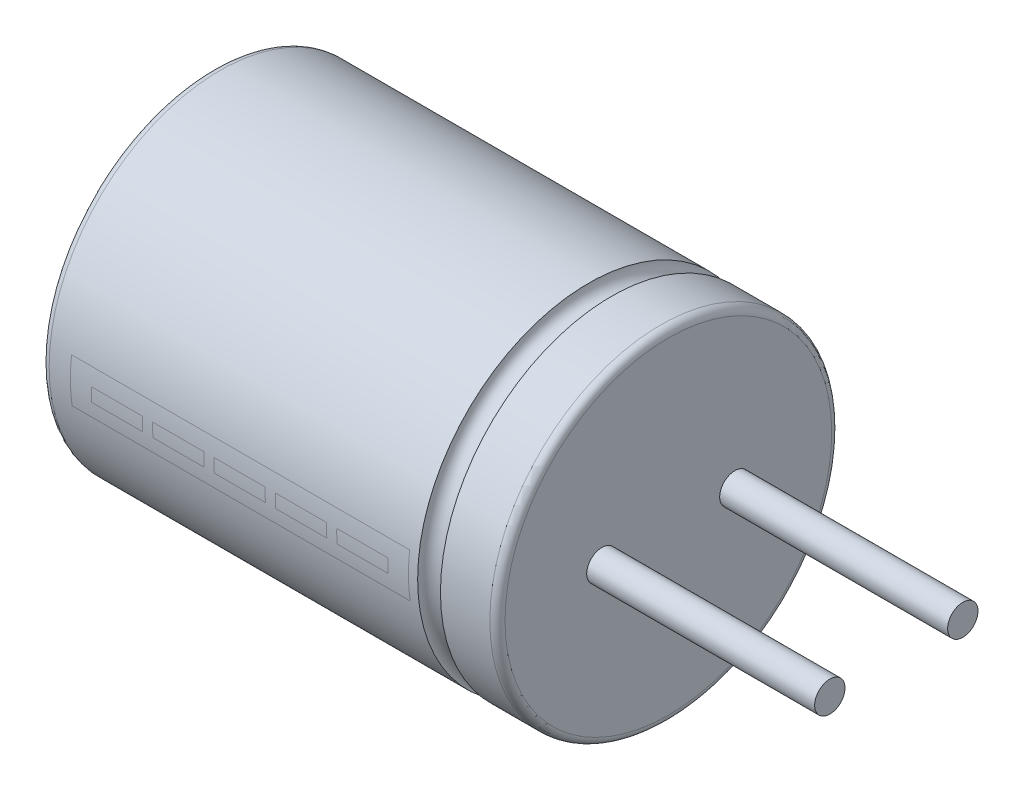
ISO-10303-21;
HEADER;
FILE_DESCRIPTION(('STEP AP214'),'2;1');
FILE_NAME('part.step','',(''),(''),'','','');
FILE_SCHEMA(('AUTOMOTIVE_DESIGN { 1 0 10303 214 1 1 1 1 }'));
ENDSEC;
DATA;
#1=APPLICATION_CONTEXT('core data for automotive mechanical design processes');
#2=APPLICATION_PROTOCOL_DEFINITION('international standard','automotive_design',2000,#1);
#3=PRODUCT_CONTEXT('',#1,'mechanical');
#4=PRODUCT('Part','Part','',(#3));
#5=PRODUCT_RELATED_PRODUCT_CATEGORY('part','',(#4));
#6=PRODUCT_DEFINITION_FORMATION('','',#4);
#7=PRODUCT_DEFINITION_CONTEXT('part definition',#1,'design');
#8=PRODUCT_DEFINITION('design','',#6,#7);
#9=PRODUCT_DEFINITION_SHAPE('','',#8);
#10=(LENGTH_UNIT() NAMED_UNIT(*) SI_UNIT(.MILLI.,.METRE.));
#11=(NAMED_UNIT(*) PLANE_ANGLE_UNIT() SI_UNIT($,.RADIAN.));
#12=(NAMED_UNIT(*) SI_UNIT($,.STERADIAN.) SOLID_ANGLE_UNIT());
#13=UNCERTAINTY_MEASURE_WITH_UNIT(LENGTH_MEASURE(1.E-05),#10,'distance_accuracy_value','');
#14=(GEOMETRIC_REPRESENTATION_CONTEXT(3) GLOBAL_UNCERTAINTY_ASSIGNED_CONTEXT((#13)) GLOBAL_UNIT_ASSIGNED_CONTEXT((#10,
#11,#12)) REPRESENTATION_CONTEXT('',''));
#15=CARTESIAN_POINT('',(0.,0.,0.));
#16=DIRECTION('',(0.,0.,1.));
#17=DIRECTION('',(1.,0.,0.));
#18=AXIS2_PLACEMENT_3D('',#15,#16,#17);
#19=CARTESIAN_POINT('',(-5.95,0.,-2.25));
#20=DIRECTION('',(-1.,0.,0.));
#21=DIRECTION('',(0.,0.,1.));
#22=AXIS2_PLACEMENT_3D('',#19,#20,#21);
#23=CYLINDRICAL_SURFACE('',#22,4.5);
#24=DIRECTION('',(-1.,0.,0.));
#25=VECTOR('',#24,1.);
#26=CARTESIAN_POINT('',(-5.95,0.531396982338142,2.21851398645701));
#27=LINE('',#26,#25);
#28=CARTESIAN_POINT('',(-5.29061789679933,0.531396982338142,2.21851398645701));
#29=VERTEX_POINT('',#28);
#30=CARTESIAN_POINT('',(3.60802987523457,0.531396982338142,2.21851398645701));
#31=VERTEX_POINT('',#30);
#32=EDGE_CURVE('E528',#29,#31,#27,.F.);
#33=ORIENTED_EDGE('',*,*,#32,.T.);
#34=CARTESIAN_POINT('',(3.60802987523457,0.,-2.25));
#35=DIRECTION('',(-1.,0.,0.));
#36=DIRECTION('',(0.,0.,1.));
#37=AXIS2_PLACEMENT_3D('',#34,#35,#36);
#38=CIRCLE('',#37,4.5);
#39=CARTESIAN_POINT('',(3.60802987523457,-0.639477724508424,2.20433140211385));
#40=VERTEX_POINT('',#39);
#41=EDGE_CURVE('E49',#31,#40,#38,.F.);
#42=ORIENTED_EDGE('',*,*,#41,.T.);
#43=DIRECTION('',(-1.,0.,0.));
#44=VECTOR('',#43,1.);
#45=CARTESIAN_POINT('',(-5.95,-0.639477724508424,2.20433140211385));
#46=LINE('',#45,#44);
#47=CARTESIAN_POINT('',(-5.29061789679933,-0.639477724508424,2.20433140211385));
#48=VERTEX_POINT('',#47);
#49=EDGE_CURVE('E41',#40,#48,#46,.T.);
#50=ORIENTED_EDGE('',*,*,#49,.T.);
#51=CARTESIAN_POINT('',(-5.29061789679933,0.,-2.25));
#52=DIRECTION('',(1.,0.,0.));
#53=DIRECTION('',(0.,0.,-1.));
#54=AXIS2_PLACEMENT_3D('',#51,#52,#53);
#55=CIRCLE('',#54,4.5);
#56=EDGE_CURVE('E532',#48,#29,#55,.F.);
#57=ORIENTED_EDGE('',*,*,#56,.T.);
#58=EDGE_LOOP('',(#33,#42,#50,#57));
#59=FACE_BOUND('',#58,.T.);
#60=CARTESIAN_POINT('',(-5.85,0.,-2.25));
#61=DIRECTION('',(-1.,0.,0.));
#62=DIRECTION('',(0.,0.,1.));
#63=AXIS2_PLACEMENT_3D('',#60,#61,#62);
#64=CIRCLE('',#63,4.5);
#65=CARTESIAN_POINT('',(-5.85,0.,2.25));
#66=VERTEX_POINT('',#65);
#67=EDGE_CURVE('E385',#66,#66,#64,.F.);
#68=ORIENTED_EDGE('',*,*,#67,.T.);
#69=EDGE_LOOP('',(#68));
#70=FACE_BOUND('',#69,.T.);
#71=CARTESIAN_POINT('',(3.85,0.,-2.25));
#72=DIRECTION('',(-1.,0.,0.));
#73=DIRECTION('',(0.,0.,1.));
#74=AXIS2_PLACEMENT_3D('',#71,#72,#73);
#75=CIRCLE('',#74,4.5);
#76=CARTESIAN_POINT('',(3.85,0.,2.25));
#77=VERTEX_POINT('',#76);
#78=EDGE_CURVE('E346',#77,#77,#75,.T.);
#79=ORIENTED_EDGE('',*,*,#78,.T.);
#80=EDGE_LOOP('',(#79));
#81=FACE_BOUND('',#80,.T.);
#82=DIRECTION('',(-1.,0.,0.));
#83=VECTOR('',#82,1.);
#84=CARTESIAN_POINT('',(-5.95,-0.639477724508424,-6.70433140211385));
#85=LINE('',#84,#83);
#86=CARTESIAN_POINT('',(-5.29061789679933,-0.639477724508424,-6.70433140211385));
#87=VERTEX_POINT('',#86);
#88=CARTESIAN_POINT('',(3.60802987523457,-0.639477724508424,-6.70433140211385));
#89=VERTEX_POINT('',#88);
#90=EDGE_CURVE('E527',#87,#89,#85,.F.);
#91=ORIENTED_EDGE('',*,*,#90,.T.);
#92=CARTESIAN_POINT('',(3.60802987523457,0.531396982338142,-6.71851398645701));
#93=VERTEX_POINT('',#92);
#94=EDGE_CURVE('E11',#89,#93,#38,.F.);
#95=ORIENTED_EDGE('',*,*,#94,.T.);
#96=DIRECTION('',(-1.,0.,0.));
#97=VECTOR('',#96,1.);
#98=CARTESIAN_POINT('',(-5.95,0.531396982338142,-6.71851398645701));
#99=LINE('',#98,#97);
#100=CARTESIAN_POINT('',(-5.29061789679933,0.531396982338142,-6.71851398645701));
#101=VERTEX_POINT('',#100);
#102=EDGE_CURVE('E47',#93,#101,#99,.T.);
#103=ORIENTED_EDGE('',*,*,#102,.T.);
#104=EDGE_CURVE('E535',#101,#87,#55,.F.);
#105=ORIENTED_EDGE('',*,*,#104,.T.);
#106=EDGE_LOOP('',(#91,#95,#103,#105));
#107=FACE_BOUND('',#106,.T.);
#108=ADVANCED_FACE('F37',(#59,#70,#81,#107),#23,.T.);
#109=ORIENTED_EDGE('',*,*,#94,.F.);
#110=ORIENTED_EDGE('',*,*,#90,.F.);
#111=ORIENTED_EDGE('',*,*,#104,.F.);
#112=ORIENTED_EDGE('',*,*,#102,.F.);
#113=EDGE_LOOP('',(#109,#110,#111,#112));
#114=FACE_BOUND('',#113,.T.);
#115=CARTESIAN_POINT('',(-4.74169300053055,0.,-2.25));
#116=DIRECTION('',(-1.,0.,0.));
#117=DIRECTION('',(0.,0.,1.));
#118=AXIS2_PLACEMENT_3D('',#115,#116,#117);
#119=CIRCLE('',#118,4.5);
#120=CARTESIAN_POINT('',(-4.74169300053055,-0.265403167091742,-6.74216664415933));
#121=VERTEX_POINT('',#120);
#122=CARTESIAN_POINT('',(-4.74169300053055,0.093571191882617,-6.74902705393618));
#123=VERTEX_POINT('',#122);
#124=EDGE_CURVE('E422',#121,#123,#119,.F.);
#125=ORIENTED_EDGE('',*,*,#124,.F.);
#126=DIRECTION('',(-1.,0.,0.));
#127=VECTOR('',#126,1.);
#128=CARTESIAN_POINT('',(-5.95,-0.265403167091742,-6.74216664415933));
#129=LINE('',#128,#127);
#130=CARTESIAN_POINT('',(-3.3955391543767,-0.265403167091742,-6.74216664415933));
#131=VERTEX_POINT('',#130);
#132=EDGE_CURVE('E388',#131,#121,#129,.T.);
#133=ORIENTED_EDGE('',*,*,#132,.F.);
#134=CARTESIAN_POINT('',(-3.3955391543767,0.,-2.25));
#135=DIRECTION('',(1.,0.,0.));
#136=DIRECTION('',(0.,0.,-1.));
#137=AXIS2_PLACEMENT_3D('',#134,#135,#136);
#138=CIRCLE('',#137,4.5);
#139=CARTESIAN_POINT('',(-3.3955391543767,0.093571191882617,-6.74902705393618));
#140=VERTEX_POINT('',#139);
#141=EDGE_CURVE('E415',#140,#131,#138,.F.);
#142=ORIENTED_EDGE('',*,*,#141,.F.);
#143=DIRECTION('',(-1.,0.,0.));
#144=VECTOR('',#143,1.);
#145=CARTESIAN_POINT('',(-5.95,0.093571191882617,-6.74902705393618));
#146=LINE('',#145,#144);
#147=EDGE_CURVE('E418',#123,#140,#146,.F.);
#148=ORIENTED_EDGE('',*,*,#147,.F.);
#149=EDGE_LOOP('',(#125,#133,#142,#148));
#150=FACE_BOUND('',#149,.T.);
#151=CARTESIAN_POINT('',(-3.12630838514593,0.,-2.25));
#152=DIRECTION('',(-1.,0.,0.));
#153=DIRECTION('',(0.,0.,1.));
#154=AXIS2_PLACEMENT_3D('',#151,#152,#153);
#155=CIRCLE('',#154,4.5);
#156=CARTESIAN_POINT('',(-3.12630838514593,-0.265403167091742,-6.74216664415933));
#157=VERTEX_POINT('',#156);
#158=CARTESIAN_POINT('',(-3.12630838514593,0.093571191882617,-6.74902705393618));
#159=VERTEX_POINT('',#158);
#160=EDGE_CURVE('E445',#157,#159,#155,.F.);
#161=ORIENTED_EDGE('',*,*,#160,.F.);
#162=DIRECTION('',(-1.,0.,0.));
#163=VECTOR('',#162,1.);
#164=CARTESIAN_POINT('',(-5.95,-0.265403167091742,-6.74216664415933));
#165=LINE('',#164,#163);
#166=CARTESIAN_POINT('',(-1.78015453899209,-0.265403167091742,-6.74216664415933));
#167=VERTEX_POINT('',#166);
#168=EDGE_CURVE('E434',#167,#157,#165,.T.);
#169=ORIENTED_EDGE('',*,*,#168,.F.);
#170=CARTESIAN_POINT('',(-1.78015453899209,0.,-2.25));
#171=DIRECTION('',(1.,0.,0.));
#172=DIRECTION('',(0.,0.,-1.));
#173=AXIS2_PLACEMENT_3D('',#170,#171,#172);
#174=CIRCLE('',#173,4.5);
#175=CARTESIAN_POINT('',(-1.78015453899209,0.093571191882617,-6.74902705393618));
#176=VERTEX_POINT('',#175);
#177=EDGE_CURVE('E438',#176,#167,#174,.F.);
#178=ORIENTED_EDGE('',*,*,#177,.F.);
#179=DIRECTION('',(-1.,0.,0.));
#180=VECTOR('',#179,1.);
#181=CARTESIAN_POINT('',(-5.95,0.093571191882617,-6.74902705393618));
#182=LINE('',#181,#180);
#183=EDGE_CURVE('E441',#159,#176,#182,.F.);
#184=ORIENTED_EDGE('',*,*,#183,.F.);
#185=EDGE_LOOP('',(#161,#169,#178,#184));
#186=FACE_BOUND('',#185,.T.);
#187=CARTESIAN_POINT('',(-1.51092376976132,0.,-2.25));
#188=DIRECTION('',(-1.,0.,0.));
#189=DIRECTION('',(0.,0.,1.));
#190=AXIS2_PLACEMENT_3D('',#187,#188,#189);
#191=CIRCLE('',#190,4.5);
#192=CARTESIAN_POINT('',(-1.51092376976132,-0.265403167091742,-6.74216664415933));
#193=VERTEX_POINT('',#192);
#194=CARTESIAN_POINT('',(-1.51092376976132,0.093571191882617,-6.74902705393618));
#195=VERTEX_POINT('',#194);
#196=EDGE_CURVE('E468',#193,#195,#191,.F.);
#197=ORIENTED_EDGE('',*,*,#196,.F.);
#198=DIRECTION('',(-1.,0.,0.));
#199=VECTOR('',#198,1.);
#200=CARTESIAN_POINT('',(-5.95,-0.265403167091742,-6.74216664415933));
#201=LINE('',#200,#199);
#202=CARTESIAN_POINT('',(-0.164769923607473,-0.265403167091742,-6.74216664415933));
#203=VERTEX_POINT('',#202);
#204=EDGE_CURVE('E457',#203,#193,#201,.T.);
#205=ORIENTED_EDGE('',*,*,#204,.F.);
#206=CARTESIAN_POINT('',(-0.164769923607473,0.,-2.25));
#207=DIRECTION('',(1.,0.,0.));
#208=DIRECTION('',(0.,0.,-1.));
#209=AXIS2_PLACEMENT_3D('',#206,#207,#208);
#210=CIRCLE('',#209,4.5);
#211=CARTESIAN_POINT('',(-0.164769923607473,0.093571191882617,-6.74902705393618));
#212=VERTEX_POINT('',#211);
#213=EDGE_CURVE('E461',#212,#203,#210,.F.);
#214=ORIENTED_EDGE('',*,*,#213,.F.);
#215=DIRECTION('',(-1.,0.,0.));
#216=VECTOR('',#215,1.);
#217=CARTESIAN_POINT('',(-5.95,0.093571191882617,-6.74902705393618));
#218=LINE('',#217,#216);
#219=EDGE_CURVE('E464',#195,#212,#218,.F.);
#220=ORIENTED_EDGE('',*,*,#219,.F.);
#221=EDGE_LOOP('',(#197,#205,#214,#220));
#222=FACE_BOUND('',#221,.T.);
#223=CARTESIAN_POINT('',(0.104460845623297,0.,-2.25));
#224=DIRECTION('',(-1.,0.,0.));
#225=DIRECTION('',(0.,0.,1.));
#226=AXIS2_PLACEMENT_3D('',#223,#224,#225);
#227=CIRCLE('',#226,4.5);
#228=CARTESIAN_POINT('',(0.104460845623297,-0.265403167091742,-6.74216664415933));
#229=VERTEX_POINT('',#228);
#230=CARTESIAN_POINT('',(0.104460845623297,0.093571191882617,-6.74902705393618));
#231=VERTEX_POINT('',#230);
#232=EDGE_CURVE('E491',#229,#231,#227,.F.);
#233=ORIENTED_EDGE('',*,*,#232,.F.);
#234=DIRECTION('',(-1.,0.,0.));
#235=VECTOR('',#234,1.);
#236=CARTESIAN_POINT('',(-5.95,-0.265403167091742,-6.74216664415933));
#237=LINE('',#236,#235);
#238=CARTESIAN_POINT('',(1.45061469177714,-0.265403167091742,-6.74216664415933));
#239=VERTEX_POINT('',#238);
#240=EDGE_CURVE('E480',#239,#229,#237,.T.);
#241=ORIENTED_EDGE('',*,*,#240,.F.);
#242=CARTESIAN_POINT('',(1.45061469177714,0.,-2.25));
#243=DIRECTION('',(1.,0.,0.));
#244=DIRECTION('',(0.,0.,-1.));
#245=AXIS2_PLACEMENT_3D('',#242,#243,#244);
#246=CIRCLE('',#245,4.5);
#247=CARTESIAN_POINT('',(1.45061469177714,0.093571191882617,-6.74902705393618));
#248=VERTEX_POINT('',#247);
#249=EDGE_CURVE('E484',#248,#239,#246,.F.);
#250=ORIENTED_EDGE('',*,*,#249,.F.);
#251=DIRECTION('',(-1.,0.,0.));
#252=VECTOR('',#251,1.);
#253=CARTESIAN_POINT('',(-5.95,0.093571191882617,-6.74902705393618));
#254=LINE('',#253,#252);
#255=EDGE_CURVE('E487',#231,#248,#254,.F.);
#256=ORIENTED_EDGE('',*,*,#255,.F.);
#257=EDGE_LOOP('',(#233,#241,#250,#256));
#258=FACE_BOUND('',#257,.T.);
#259=CARTESIAN_POINT('',(1.71984546100791,0.,-2.25));
#260=DIRECTION('',(-1.,0.,0.));
#261=DIRECTION('',(0.,0.,1.));
#262=AXIS2_PLACEMENT_3D('',#259,#260,#261);
#263=CIRCLE('',#262,4.5);
#264=CARTESIAN_POINT('',(1.71984546100791,-0.265403167091742,-6.74216664415933));
#265=VERTEX_POINT('',#264);
#266=CARTESIAN_POINT('',(1.71984546100791,0.093571191882617,-6.74902705393618));
#267=VERTEX_POINT('',#266);
#268=EDGE_CURVE('E514',#265,#267,#263,.F.);
#269=ORIENTED_EDGE('',*,*,#268,.F.);
#270=DIRECTION('',(-1.,0.,0.));
#271=VECTOR('',#270,1.);
#272=CARTESIAN_POINT('',(-5.95,-0.265403167091742,-6.74216664415933));
#273=LINE('',#272,#271);
#274=CARTESIAN_POINT('',(3.06599930716176,-0.265403167091742,-6.74216664415933));
#275=VERTEX_POINT('',#274);
#276=EDGE_CURVE('E503',#275,#265,#273,.T.);
#277=ORIENTED_EDGE('',*,*,#276,.F.);
#278=CARTESIAN_POINT('',(3.06599930716176,0.,-2.25));
#279=DIRECTION('',(1.,0.,0.));
#280=DIRECTION('',(0.,0.,-1.));
#281=AXIS2_PLACEMENT_3D('',#278,#279,#280);
#282=CIRCLE('',#281,4.5);
#283=CARTESIAN_POINT('',(3.06599930716176,0.093571191882617,-6.74902705393618));
#284=VERTEX_POINT('',#283);
#285=EDGE_CURVE('E507',#284,#275,#282,.F.);
#286=ORIENTED_EDGE('',*,*,#285,.F.);
#287=DIRECTION('',(-1.,0.,0.));
#288=VECTOR('',#287,1.);
#289=CARTESIAN_POINT('',(-5.95,0.093571191882617,-6.74902705393618));
#290=LINE('',#289,#288);
#291=EDGE_CURVE('E510',#267,#284,#290,.F.);
#292=ORIENTED_EDGE('',*,*,#291,.F.);
#293=EDGE_LOOP('',(#269,#277,#286,#292));
#294=FACE_BOUND('',#293,.T.);
#295=ADVANCED_FACE('F546',(#114,#150,#186,#222,#258,#294),#23,.T.);
#296=DIRECTION('',(-1.,0.,0.));
#297=VECTOR('',#296,1.);
#298=CARTESIAN_POINT('',(-5.95,0.093571191882617,2.24902705393618));
#299=LINE('',#298,#297);
#300=CARTESIAN_POINT('',(3.06599930716176,0.093571191882617,2.24902705393618));
#301=VERTEX_POINT('',#300);
#302=CARTESIAN_POINT('',(1.71984546100791,0.093571191882617,2.24902705393618));
#303=VERTEX_POINT('',#302);
#304=EDGE_CURVE('E522',#301,#303,#299,.T.);
#305=ORIENTED_EDGE('',*,*,#304,.T.);
#306=CARTESIAN_POINT('',(1.71984546100791,-0.265403167091742,2.24216664415933));
#307=VERTEX_POINT('',#306);
#308=EDGE_CURVE('E518',#303,#307,#263,.F.);
#309=ORIENTED_EDGE('',*,*,#308,.T.);
#310=DIRECTION('',(-1.,0.,0.));
#311=VECTOR('',#310,1.);
#312=CARTESIAN_POINT('',(-5.95,-0.265403167091742,2.24216664415933));
#313=LINE('',#312,#311);
#314=CARTESIAN_POINT('',(3.06599930716176,-0.265403167091742,2.24216664415933));
#315=VERTEX_POINT('',#314);
#316=EDGE_CURVE('E517',#307,#315,#313,.F.);
#317=ORIENTED_EDGE('',*,*,#316,.T.);
#318=EDGE_CURVE('E511',#315,#301,#282,.F.);
#319=ORIENTED_EDGE('',*,*,#318,.T.);
#320=EDGE_LOOP('',(#305,#309,#317,#319));
#321=FACE_BOUND('',#320,.T.);
#322=ADVANCED_FACE('F549',(#321),#23,.T.);
#323=ORIENTED_EDGE('',*,*,#276,.T.);
#324=ORIENTED_EDGE('',*,*,#268,.T.);
#325=ORIENTED_EDGE('',*,*,#291,.T.);
#326=ORIENTED_EDGE('',*,*,#285,.T.);
#327=EDGE_LOOP('',(#323,#324,#325,#326));
#328=FACE_BOUND('',#327,.T.);
#329=ADVANCED_FACE('F567',(#328),#23,.T.);
#330=DIRECTION('',(-1.,0.,0.));
#331=VECTOR('',#330,1.);
#332=CARTESIAN_POINT('',(-5.95,0.093571191882617,2.24902705393618));
#333=LINE('',#332,#331);
#334=CARTESIAN_POINT('',(1.45061469177714,0.093571191882617,2.24902705393618));
#335=VERTEX_POINT('',#334);
#336=CARTESIAN_POINT('',(0.104460845623297,0.093571191882617,2.24902705393618));
#337=VERTEX_POINT('',#336);
#338=EDGE_CURVE('E499',#335,#337,#333,.T.);
#339=ORIENTED_EDGE('',*,*,#338,.T.);
#340=CARTESIAN_POINT('',(0.104460845623297,-0.265403167091742,2.24216664415933));
#341=VERTEX_POINT('',#340);
#342=EDGE_CURVE('E495',#337,#341,#227,.F.);
#343=ORIENTED_EDGE('',*,*,#342,.T.);
#344=DIRECTION('',(-1.,0.,0.));
#345=VECTOR('',#344,1.);
#346=CARTESIAN_POINT('',(-5.95,-0.265403167091742,2.24216664415933));
#347=LINE('',#346,#345);
#348=CARTESIAN_POINT('',(1.45061469177714,-0.265403167091742,2.24216664415933));
#349=VERTEX_POINT('',#348);
#350=EDGE_CURVE('E494',#341,#349,#347,.F.);
#351=ORIENTED_EDGE('',*,*,#350,.T.);
#352=EDGE_CURVE('E488',#349,#335,#246,.F.);
#353=ORIENTED_EDGE('',*,*,#352,.T.);
#354=EDGE_LOOP('',(#339,#343,#351,#353));
#355=FACE_BOUND('',#354,.T.);
#356=ADVANCED_FACE('F569',(#355),#23,.T.);
#357=ORIENTED_EDGE('',*,*,#240,.T.);
#358=ORIENTED_EDGE('',*,*,#232,.T.);
#359=ORIENTED_EDGE('',*,*,#255,.T.);
#360=ORIENTED_EDGE('',*,*,#249,.T.);
#361=EDGE_LOOP('',(#357,#358,#359,#360));
#362=FACE_BOUND('',#361,.T.);
#363=ADVANCED_FACE('F574',(#362),#23,.T.);
#364=DIRECTION('',(-1.,0.,0.));
#365=VECTOR('',#364,1.);
#366=CARTESIAN_POINT('',(-5.95,0.093571191882617,2.24902705393618));
#367=LINE('',#366,#365);
#368=CARTESIAN_POINT('',(-0.164769923607473,0.093571191882617,2.24902705393618));
#369=VERTEX_POINT('',#368);
#370=CARTESIAN_POINT('',(-1.51092376976132,0.093571191882617,2.24902705393618));
#371=VERTEX_POINT('',#370);
#372=EDGE_CURVE('E476',#369,#371,#367,.T.);
#373=ORIENTED_EDGE('',*,*,#372,.T.);
#374=CARTESIAN_POINT('',(-1.51092376976132,-0.265403167091742,2.24216664415933));
#375=VERTEX_POINT('',#374);
#376=EDGE_CURVE('E472',#371,#375,#191,.F.);
#377=ORIENTED_EDGE('',*,*,#376,.T.);
#378=DIRECTION('',(-1.,0.,0.));
#379=VECTOR('',#378,1.);
#380=CARTESIAN_POINT('',(-5.95,-0.265403167091742,2.24216664415933));
#381=LINE('',#380,#379);
#382=CARTESIAN_POINT('',(-0.164769923607473,-0.265403167091742,2.24216664415933));
#383=VERTEX_POINT('',#382);
#384=EDGE_CURVE('E471',#375,#383,#381,.F.);
#385=ORIENTED_EDGE('',*,*,#384,.T.);
#386=EDGE_CURVE('E465',#383,#369,#210,.F.);
#387=ORIENTED_EDGE('',*,*,#386,.T.);
#388=EDGE_LOOP('',(#373,#377,#385,#387));
#389=FACE_BOUND('',#388,.T.);
#390=ADVANCED_FACE('F737',(#389),#23,.T.);
#391=ORIENTED_EDGE('',*,*,#204,.T.);
#392=ORIENTED_EDGE('',*,*,#196,.T.);
#393=ORIENTED_EDGE('',*,*,#219,.T.);
#394=ORIENTED_EDGE('',*,*,#213,.T.);
#395=EDGE_LOOP('',(#391,#392,#393,#394));
#396=FACE_BOUND('',#395,.T.);
#397=ADVANCED_FACE('F733',(#396),#23,.T.);
#398=DIRECTION('',(-1.,0.,0.));
#399=VECTOR('',#398,1.);
#400=CARTESIAN_POINT('',(-5.95,0.093571191882617,2.24902705393618));
#401=LINE('',#400,#399);
#402=CARTESIAN_POINT('',(-1.78015453899209,0.093571191882617,2.24902705393618));
#403=VERTEX_POINT('',#402);
#404=CARTESIAN_POINT('',(-3.12630838514593,0.093571191882617,2.24902705393618));
#405=VERTEX_POINT('',#404);
#406=EDGE_CURVE('E453',#403,#405,#401,.T.);
#407=ORIENTED_EDGE('',*,*,#406,.T.);
#408=CARTESIAN_POINT('',(-3.12630838514593,-0.265403167091742,2.24216664415933));
#409=VERTEX_POINT('',#408);
#410=EDGE_CURVE('E449',#405,#409,#155,.F.);
#411=ORIENTED_EDGE('',*,*,#410,.T.);
#412=DIRECTION('',(-1.,0.,0.));
#413=VECTOR('',#412,1.);
#414=CARTESIAN_POINT('',(-5.95,-0.265403167091742,2.24216664415933));
#415=LINE('',#414,#413);
#416=CARTESIAN_POINT('',(-1.78015453899209,-0.265403167091742,2.24216664415933));
#417=VERTEX_POINT('',#416);
#418=EDGE_CURVE('E448',#409,#417,#415,.F.);
#419=ORIENTED_EDGE('',*,*,#418,.T.);
#420=EDGE_CURVE('E442',#417,#403,#174,.F.);
#421=ORIENTED_EDGE('',*,*,#420,.T.);
#422=EDGE_LOOP('',(#407,#411,#419,#421));
#423=FACE_BOUND('',#422,.T.);
#424=ADVANCED_FACE('F614',(#423),#23,.T.);
#425=ORIENTED_EDGE('',*,*,#168,.T.);
#426=ORIENTED_EDGE('',*,*,#160,.T.);
#427=ORIENTED_EDGE('',*,*,#183,.T.);
#428=ORIENTED_EDGE('',*,*,#177,.T.);
#429=EDGE_LOOP('',(#425,#426,#427,#428));
#430=FACE_BOUND('',#429,.T.);
#431=ADVANCED_FACE('F608',(#430),#23,.T.);
#432=DIRECTION('',(-1.,0.,0.));
#433=VECTOR('',#432,1.);
#434=CARTESIAN_POINT('',(-5.95,0.093571191882617,2.24902705393618));
#435=LINE('',#434,#433);
#436=CARTESIAN_POINT('',(-3.3955391543767,0.093571191882617,2.24902705393618));
#437=VERTEX_POINT('',#436);
#438=CARTESIAN_POINT('',(-4.74169300053055,0.093571191882617,2.24902705393618));
#439=VERTEX_POINT('',#438);
#440=EDGE_CURVE('E430',#437,#439,#435,.T.);
#441=ORIENTED_EDGE('',*,*,#440,.T.);
#442=CARTESIAN_POINT('',(-4.74169300053055,-0.265403167091742,2.24216664415933));
#443=VERTEX_POINT('',#442);
#444=EDGE_CURVE('E426',#439,#443,#119,.F.);
#445=ORIENTED_EDGE('',*,*,#444,.T.);
#446=DIRECTION('',(-1.,0.,0.));
#447=VECTOR('',#446,1.);
#448=CARTESIAN_POINT('',(-5.95,-0.265403167091742,2.24216664415933));
#449=LINE('',#448,#447);
#450=CARTESIAN_POINT('',(-3.3955391543767,-0.265403167091742,2.24216664415933));
#451=VERTEX_POINT('',#450);
#452=EDGE_CURVE('E425',#443,#451,#449,.F.);
#453=ORIENTED_EDGE('',*,*,#452,.T.);
#454=EDGE_CURVE('E419',#451,#437,#138,.F.);
#455=ORIENTED_EDGE('',*,*,#454,.T.);
#456=EDGE_LOOP('',(#441,#445,#453,#455));
#457=FACE_BOUND('',#456,.T.);
#458=ADVANCED_FACE('F600',(#457),#23,.T.);
#459=ORIENTED_EDGE('',*,*,#132,.T.);
#460=ORIENTED_EDGE('',*,*,#124,.T.);
#461=ORIENTED_EDGE('',*,*,#147,.T.);
#462=ORIENTED_EDGE('',*,*,#141,.T.);
#463=EDGE_LOOP('',(#459,#460,#461,#462));
#464=FACE_BOUND('',#463,.T.);
#465=ADVANCED_FACE('F589',(#464),#23,.T.);
#466=CARTESIAN_POINT('',(-5.95,0.,-2.25));
#467=DIRECTION('',(-1.,0.,0.));
#468=DIRECTION('',(0.,0.,1.));
#469=AXIS2_PLACEMENT_3D('',#466,#467,#468);
#470=CYLINDRICAL_SURFACE('',#469,4.5);
#471=CARTESIAN_POINT('',(5.75,0.,-2.25));
#472=DIRECTION('',(1.,0.,0.));
#473=DIRECTION('',(0.,0.,-1.));
#474=AXIS2_PLACEMENT_3D('',#471,#472,#473);
#475=CIRCLE('',#474,4.5);
#476=CARTESIAN_POINT('',(5.75,0.,-6.75));
#477=VERTEX_POINT('',#476);
#478=EDGE_CURVE('E352',#477,#477,#475,.F.);
#479=ORIENTED_EDGE('',*,*,#478,.T.);
#480=EDGE_LOOP('',(#479));
#481=FACE_BOUND('',#480,.T.);
#482=CARTESIAN_POINT('',(4.45,0.,-2.25));
#483=DIRECTION('',(-1.,0.,0.));
#484=DIRECTION('',(0.,0.,1.));
#485=AXIS2_PLACEMENT_3D('',#482,#483,#484);
#486=CIRCLE('',#485,4.5);
#487=CARTESIAN_POINT('',(4.45,0.,2.25));
#488=VERTEX_POINT('',#487);
#489=EDGE_CURVE('E349',#488,#488,#486,.T.);
#490=ORIENTED_EDGE('',*,*,#489,.F.);
#491=EDGE_LOOP('',(#490));
#492=FACE_BOUND('',#491,.T.);
#493=ADVANCED_FACE('F596',(#481,#492),#470,.T.);
#494=CARTESIAN_POINT('',(4.15,0.,-2.25));
#495=DIRECTION('',(-1.,0.,0.));
#496=DIRECTION('',(0.,0.,1.));
#497=AXIS2_PLACEMENT_3D('',#494,#495,#496);
#498=TOROIDAL_SURFACE('',#497,4.5,0.3);
#499=ORIENTED_EDGE('',*,*,#489,.T.);
#500=EDGE_LOOP('',(#499));
#501=FACE_BOUND('',#500,.T.);
#502=ORIENTED_EDGE('',*,*,#78,.F.);
#503=EDGE_LOOP('',(#502));
#504=FACE_BOUND('',#503,.T.);
#505=ADVANCED_FACE('F587',(#501,#504),#498,.F.);
#506=ORIENTED_EDGE('',*,*,#41,.F.);
#507=ORIENTED_EDGE('',*,*,#32,.F.);
#508=ORIENTED_EDGE('',*,*,#56,.F.);
#509=ORIENTED_EDGE('',*,*,#49,.F.);
#510=EDGE_LOOP('',(#506,#507,#508,#509));
#511=FACE_BOUND('',#510,.T.);
#512=ORIENTED_EDGE('',*,*,#308,.F.);
#513=ORIENTED_EDGE('',*,*,#304,.F.);
#514=ORIENTED_EDGE('',*,*,#318,.F.);
#515=ORIENTED_EDGE('',*,*,#316,.F.);
#516=EDGE_LOOP('',(#512,#513,#514,#515));
#517=FACE_BOUND('',#516,.T.);
#518=ORIENTED_EDGE('',*,*,#342,.F.);
#519=ORIENTED_EDGE('',*,*,#338,.F.);
#520=ORIENTED_EDGE('',*,*,#352,.F.);
#521=ORIENTED_EDGE('',*,*,#350,.F.);
#522=EDGE_LOOP('',(#518,#519,#520,#521));
#523=FACE_BOUND('',#522,.T.);
#524=ORIENTED_EDGE('',*,*,#376,.F.);
#525=ORIENTED_EDGE('',*,*,#372,.F.);
#526=ORIENTED_EDGE('',*,*,#386,.F.);
#527=ORIENTED_EDGE('',*,*,#384,.F.);
#528=EDGE_LOOP('',(#524,#525,#526,#527));
#529=FACE_BOUND('',#528,.T.);
#530=ORIENTED_EDGE('',*,*,#410,.F.);
#531=ORIENTED_EDGE('',*,*,#406,.F.);
#532=ORIENTED_EDGE('',*,*,#420,.F.);
#533=ORIENTED_EDGE('',*,*,#418,.F.);
#534=EDGE_LOOP('',(#530,#531,#532,#533));
#535=FACE_BOUND('',#534,.T.);
#536=ORIENTED_EDGE('',*,*,#444,.F.);
#537=ORIENTED_EDGE('',*,*,#440,.F.);
#538=ORIENTED_EDGE('',*,*,#454,.F.);
#539=ORIENTED_EDGE('',*,*,#452,.F.);
#540=EDGE_LOOP('',(#536,#537,#538,#539));
#541=FACE_BOUND('',#540,.T.);
#542=ADVANCED_FACE('F577',(#511,#517,#523,#529,#535,#541),#23,.T.);
#543=CARTESIAN_POINT('',(-6.05,0.,1.25));
#544=DIRECTION('',(-1.,0.,0.));
#545=DIRECTION('',(0.,0.,1.));
#546=AXIS2_PLACEMENT_3D('',#543,#544,#545);
#547=PLANE('',#546);
#548=CARTESIAN_POINT('',(-6.05,0.,-2.25));
#549=DIRECTION('',(-1.,0.,0.));
#550=DIRECTION('',(0.,0.,1.));
#551=AXIS2_PLACEMENT_3D('',#548,#549,#550);
#552=CIRCLE('',#551,4.3);
#553=CARTESIAN_POINT('',(-6.05,0.,2.05));
#554=VERTEX_POINT('',#553);
#555=EDGE_CURVE('E382',#554,#554,#552,.T.);
#556=ORIENTED_EDGE('',*,*,#555,.T.);
#557=EDGE_LOOP('',(#556));
#558=FACE_BOUND('',#557,.T.);
#559=CARTESIAN_POINT('',(-6.05,0.,-2.25));
#560=DIRECTION('',(-1.,0.,0.));
#561=DIRECTION('',(0.,0.,1.));
#562=AXIS2_PLACEMENT_3D('',#559,#560,#561);
#563=CIRCLE('',#562,3.5);
#564=CARTESIAN_POINT('',(-6.05,0.,1.25));
#565=VERTEX_POINT('',#564);
#566=EDGE_CURVE('E343',#565,#565,#563,.T.);
#567=ORIENTED_EDGE('',*,*,#566,.F.);
#568=EDGE_LOOP('',(#567));
#569=FACE_BOUND('',#568,.T.);
#570=ADVANCED_FACE('F586',(#558,#569),#547,.T.);
#571=CARTESIAN_POINT('',(-5.95,0.,-2.25));
#572=DIRECTION('',(-1.,0.,0.));
#573=DIRECTION('',(0.,0.,1.));
#574=AXIS2_PLACEMENT_3D('',#571,#572,#573);
#575=CYLINDRICAL_SURFACE('',#574,3.5);
#576=ORIENTED_EDGE('',*,*,#566,.T.);
#577=EDGE_LOOP('',(#576));
#578=FACE_BOUND('',#577,.T.);
#579=CARTESIAN_POINT('',(-5.95,0.,-2.25));
#580=DIRECTION('',(-1.,0.,0.));
#581=DIRECTION('',(0.,0.,1.));
#582=AXIS2_PLACEMENT_3D('',#579,#580,#581);
#583=CIRCLE('',#582,3.5);
#584=CARTESIAN_POINT('',(-5.95,0.,1.25));
#585=VERTEX_POINT('',#584);
#586=EDGE_CURVE('E338',#585,#585,#583,.T.);
#587=ORIENTED_EDGE('',*,*,#586,.F.);
#588=EDGE_LOOP('',(#587));
#589=FACE_BOUND('',#588,.T.);
#590=ADVANCED_FACE('F594',(#578,#589),#575,.F.);
#591=CARTESIAN_POINT('',(-5.95,0.,-2.25));
#592=DIRECTION('',(-1.,0.,0.));
#593=DIRECTION('',(0.,0.,1.));
#594=AXIS2_PLACEMENT_3D('',#591,#592,#593);
#595=PLANE('',#594);
#596=DIRECTION('',(0.,0.,1.));
#597=VECTOR('',#596,1.);
#598=CARTESIAN_POINT('',(-5.95,-3.324999999995,-2.500000000005));
#599=LINE('',#598,#597);
#600=CARTESIAN_POINT('',(-5.95,-3.324999999995,-2.500000000005));
#601=VERTEX_POINT('',#600);
#602=CARTESIAN_POINT('',(-5.95,-3.324999999995,-2.000000000005));
#603=VERTEX_POINT('',#602);
#604=EDGE_CURVE('E274',#601,#603,#599,.T.);
#605=ORIENTED_EDGE('',*,*,#604,.F.);
#606=DIRECTION('',(0.,-1.,0.));
#607=VECTOR('',#606,1.);
#608=CARTESIAN_POINT('',(-5.95,-0.25,-2.500000000005));
#609=LINE('',#608,#607);
#610=CARTESIAN_POINT('',(-5.95,-0.25,-2.500000000005));
#611=VERTEX_POINT('',#610);
#612=EDGE_CURVE('E326',#611,#601,#609,.T.);
#613=ORIENTED_EDGE('',*,*,#612,.F.);
#614=DIRECTION('',(0.,0.,1.));
#615=VECTOR('',#614,1.);
#616=CARTESIAN_POINT('',(-5.95,-0.25,-5.575));
#617=LINE('',#616,#615);
#618=CARTESIAN_POINT('',(-5.95,-0.25,-5.575));
#619=VERTEX_POINT('',#618);
#620=EDGE_CURVE('E323',#619,#611,#617,.T.);
#621=ORIENTED_EDGE('',*,*,#620,.F.);
#622=DIRECTION('',(0.,-1.,0.));
#623=VECTOR('',#622,1.);
#624=CARTESIAN_POINT('',(-5.95,0.25,-5.575));
#625=LINE('',#624,#623);
#626=CARTESIAN_POINT('',(-5.95,0.25,-5.575));
#627=VERTEX_POINT('',#626);
#628=EDGE_CURVE('E320',#627,#619,#625,.T.);
#629=ORIENTED_EDGE('',*,*,#628,.F.);
#630=DIRECTION('',(0.,0.,-1.));
#631=VECTOR('',#630,1.);
#632=CARTESIAN_POINT('',(-5.95,0.25,-5.575));
#633=LINE('',#632,#631);
#634=CARTESIAN_POINT('',(-5.95,0.25,-2.500000000005));
#635=VERTEX_POINT('',#634);
#636=EDGE_CURVE('E317',#635,#627,#633,.T.);
#637=ORIENTED_EDGE('',*,*,#636,.F.);
#638=DIRECTION('',(0.,-1.,0.));
#639=VECTOR('',#638,1.);
#640=CARTESIAN_POINT('',(-5.95,3.325000000005,-2.500000000005));
#641=LINE('',#640,#639);
#642=CARTESIAN_POINT('',(-5.95,3.325000000005,-2.500000000005));
#643=VERTEX_POINT('',#642);
#644=EDGE_CURVE('E314',#643,#635,#641,.T.);
#645=ORIENTED_EDGE('',*,*,#644,.F.);
#646=DIRECTION('',(0.,0.,-1.));
#647=VECTOR('',#646,1.);
#648=CARTESIAN_POINT('',(-5.95,3.325000000005,-2.500000000005));
#649=LINE('',#648,#647);
#650=CARTESIAN_POINT('',(-5.95,3.325000000005,-2.000000000005));
#651=VERTEX_POINT('',#650);
#652=EDGE_CURVE('E311',#651,#643,#649,.T.);
#653=ORIENTED_EDGE('',*,*,#652,.F.);
#654=DIRECTION('',(0.,1.,0.));
#655=VECTOR('',#654,1.);
#656=CARTESIAN_POINT('',(-5.95,3.325000000005,-2.000000000005));
#657=LINE('',#656,#655);
#658=CARTESIAN_POINT('',(-5.95,0.25,-2.000000000005));
#659=VERTEX_POINT('',#658);
#660=EDGE_CURVE('E308',#659,#651,#657,.T.);
#661=ORIENTED_EDGE('',*,*,#660,.F.);
#662=DIRECTION('',(0.,0.,-1.));
#663=VECTOR('',#662,1.);
#664=CARTESIAN_POINT('',(-5.95,0.25,-2.000000000005));
#665=LINE('',#664,#663);
#666=CARTESIAN_POINT('',(-5.95,0.25,1.075));
#667=VERTEX_POINT('',#666);
#668=EDGE_CURVE('E305',#667,#659,#665,.T.);
#669=ORIENTED_EDGE('',*,*,#668,.F.);
#670=DIRECTION('',(0.,1.,0.));
#671=VECTOR('',#670,1.);
#672=CARTESIAN_POINT('',(-5.95,0.25,1.075));
#673=LINE('',#672,#671);
#674=CARTESIAN_POINT('',(-5.95,-0.25,1.075));
#675=VERTEX_POINT('',#674);
#676=EDGE_CURVE('E302',#675,#667,#673,.T.);
#677=ORIENTED_EDGE('',*,*,#676,.F.);
#678=DIRECTION('',(0.,0.,1.));
#679=VECTOR('',#678,1.);
#680=CARTESIAN_POINT('',(-5.95,-0.25,-2.000000000005));
#681=LINE('',#680,#679);
#682=CARTESIAN_POINT('',(-5.95,-0.25,-2.000000000005));
#683=VERTEX_POINT('',#682);
#684=EDGE_CURVE('E277',#683,#675,#681,.T.);
#685=ORIENTED_EDGE('',*,*,#684,.F.);
#686=DIRECTION('',(0.,1.,0.));
#687=VECTOR('',#686,1.);
#688=CARTESIAN_POINT('',(-5.95,-0.25,-2.000000000005));
#689=LINE('',#688,#687);
#690=EDGE_CURVE('E268',#603,#683,#689,.T.);
#691=ORIENTED_EDGE('',*,*,#690,.F.);
#692=EDGE_LOOP('',(#605,#613,#621,#629,#637,#645,#653,#661,#669,#677,#685,#691));
#693=FACE_BOUND('',#692,.T.);
#694=ORIENTED_EDGE('',*,*,#586,.T.);
#695=EDGE_LOOP('',(#694));
#696=FACE_BOUND('',#695,.T.);
#697=ADVANCED_FACE('F270',(#693,#696),#595,.T.);
#698=CARTESIAN_POINT('',(5.95,0.,-2.25));
#699=DIRECTION('',(1.,0.,0.));
#700=DIRECTION('',(0.,0.,-1.));
#701=AXIS2_PLACEMENT_3D('',#698,#699,#700);
#702=PLANE('',#701);
#703=CARTESIAN_POINT('',(5.95,0.,-2.25));
#704=DIRECTION('',(1.,0.,0.));
#705=DIRECTION('',(0.,0.,-1.));
#706=AXIS2_PLACEMENT_3D('',#703,#704,#705);
#707=CIRCLE('',#706,4.3);
#708=CARTESIAN_POINT('',(5.95,0.,-6.55));
#709=VERTEX_POINT('',#708);
#710=EDGE_CURVE('E355',#709,#709,#707,.T.);
#711=ORIENTED_EDGE('',*,*,#710,.T.);
#712=EDGE_LOOP('',(#711));
#713=FACE_BOUND('',#712,.T.);
#714=CARTESIAN_POINT('',(5.95,0.,-4.));
#715=DIRECTION('',(1.,0.,0.));
#716=DIRECTION('',(0.,0.,-1.));
#717=AXIS2_PLACEMENT_3D('',#714,#715,#716);
#718=CIRCLE('',#717,0.4);
#719=CARTESIAN_POINT('',(5.95,0.,-4.4));
#720=VERTEX_POINT('',#719);
#721=EDGE_CURVE('E328',#720,#720,#718,.T.);
#722=ORIENTED_EDGE('',*,*,#721,.F.);
#723=EDGE_LOOP('',(#722));
#724=FACE_BOUND('',#723,.T.);
#725=CARTESIAN_POINT('',(5.95,0.,-0.499999999999999));
#726=DIRECTION('',(1.,0.,0.));
#727=DIRECTION('',(0.,0.,-1.));
#728=AXIS2_PLACEMENT_3D('',#725,#726,#727);
#729=CIRCLE('',#728,0.4);
#730=CARTESIAN_POINT('',(5.95,0.,-0.9));
#731=VERTEX_POINT('',#730);
#732=EDGE_CURVE('E332',#731,#731,#729,.T.);
#733=ORIENTED_EDGE('',*,*,#732,.F.);
#734=EDGE_LOOP('',(#733));
#735=FACE_BOUND('',#734,.T.);
#736=ADVANCED_FACE('F1002',(#713,#724,#735),#702,.T.);
#737=CARTESIAN_POINT('',(11.95,0.,-0.499999999999999));
#738=DIRECTION('',(-1.,0.,0.));
#739=DIRECTION('',(0.,0.,1.));
#740=AXIS2_PLACEMENT_3D('',#737,#738,#739);
#741=CYLINDRICAL_SURFACE('',#740,0.4);
#742=CARTESIAN_POINT('',(11.95,0.,-0.499999999999999));
#743=DIRECTION('',(1.,0.,0.));
#744=DIRECTION('',(0.,0.,-1.));
#745=AXIS2_PLACEMENT_3D('',#742,#743,#744);
#746=CIRCLE('',#745,0.4);
#747=CARTESIAN_POINT('',(11.95,0.,-0.9));
#748=VERTEX_POINT('',#747);
#749=EDGE_CURVE('E335',#748,#748,#746,.T.);
#750=ORIENTED_EDGE('',*,*,#749,.F.);
#751=EDGE_LOOP('',(#750));
#752=FACE_BOUND('',#751,.T.);
#753=ORIENTED_EDGE('',*,*,#732,.T.);
#754=EDGE_LOOP('',(#753));
#755=FACE_BOUND('',#754,.T.);
#756=ADVANCED_FACE('F993',(#752,#755),#741,.T.);
#757=CARTESIAN_POINT('',(11.95,0.,-0.499999999999999));
#758=DIRECTION('',(1.,0.,0.));
#759=DIRECTION('',(0.,0.,-1.));
#760=AXIS2_PLACEMENT_3D('',#757,#758,#759);
#761=PLANE('',#760);
#762=ORIENTED_EDGE('',*,*,#749,.T.);
#763=EDGE_LOOP('',(#762));
#764=FACE_BOUND('',#763,.T.);
#765=ADVANCED_FACE('F984',(#764),#761,.T.);
#766=CARTESIAN_POINT('',(11.95,0.,-4.));
#767=DIRECTION('',(-1.,0.,0.));
#768=DIRECTION('',(0.,0.,1.));
#769=AXIS2_PLACEMENT_3D('',#766,#767,#768);
#770=CYLINDRICAL_SURFACE('',#769,0.4);
#771=CARTESIAN_POINT('',(11.95,0.,-4.));
#772=DIRECTION('',(1.,0.,0.));
#773=DIRECTION('',(0.,0.,-1.));
#774=AXIS2_PLACEMENT_3D('',#771,#772,#773);
#775=CIRCLE('',#774,0.4);
#776=CARTESIAN_POINT('',(11.95,0.,-4.4));
#777=VERTEX_POINT('',#776);
#778=EDGE_CURVE('E329',#777,#777,#775,.T.);
#779=ORIENTED_EDGE('',*,*,#778,.F.);
#780=EDGE_LOOP('',(#779));
#781=FACE_BOUND('',#780,.T.);
#782=ORIENTED_EDGE('',*,*,#721,.T.);
#783=EDGE_LOOP('',(#782));
#784=FACE_BOUND('',#783,.T.);
#785=ADVANCED_FACE('F974',(#781,#784),#770,.T.);
#786=CARTESIAN_POINT('',(11.95,0.,-4.));
#787=DIRECTION('',(1.,0.,0.));
#788=DIRECTION('',(0.,0.,-1.));
#789=AXIS2_PLACEMENT_3D('',#786,#787,#788);
#790=PLANE('',#789);
#791=ORIENTED_EDGE('',*,*,#778,.T.);
#792=EDGE_LOOP('',(#791));
#793=FACE_BOUND('',#792,.T.);
#794=ADVANCED_FACE('F964',(#793),#790,.T.);
#795=CARTESIAN_POINT('',(-5.75,0.,0.));
#796=DIRECTION('',(1.,0.,0.));
#797=DIRECTION('',(0.,0.,-1.));
#798=AXIS2_PLACEMENT_3D('',#795,#796,#797);
#799=PLANE('',#798);
#800=DIRECTION('',(0.,0.,1.));
#801=VECTOR('',#800,1.);
#802=CARTESIAN_POINT('',(-5.75,-0.05,-2.500000000005));
#803=LINE('',#802,#801);
#804=CARTESIAN_POINT('',(-5.75,-0.05,-5.375));
#805=VERTEX_POINT('',#804);
#806=CARTESIAN_POINT('',(-5.75,-0.05,-2.300000000005));
#807=VERTEX_POINT('',#806);
#808=EDGE_CURVE('E377',#805,#807,#803,.T.);
#809=ORIENTED_EDGE('',*,*,#808,.T.);
#810=DIRECTION('',(0.,-1.,0.));
#811=VECTOR('',#810,1.);
#812=CARTESIAN_POINT('',(-5.75,-3.324999999995,-2.300000000005));
#813=LINE('',#812,#811);
#814=CARTESIAN_POINT('',(-5.75,-3.124999999995,-2.300000000005));
#815=VERTEX_POINT('',#814);
#816=EDGE_CURVE('E379',#807,#815,#813,.T.);
#817=ORIENTED_EDGE('',*,*,#816,.T.);
#818=DIRECTION('',(0.,0.,1.));
#819=VECTOR('',#818,1.);
#820=CARTESIAN_POINT('',(-5.75,-3.124999999995,-2.000000000005));
#821=LINE('',#820,#819);
#822=CARTESIAN_POINT('',(-5.75,-3.124999999995,-2.200000000005));
#823=VERTEX_POINT('',#822);
#824=EDGE_CURVE('E358',#815,#823,#821,.T.);
#825=ORIENTED_EDGE('',*,*,#824,.T.);
#826=DIRECTION('',(0.,1.,0.));
#827=VECTOR('',#826,1.);
#828=CARTESIAN_POINT('',(-5.75,-0.25,-2.200000000005));
#829=LINE('',#828,#827);
#830=CARTESIAN_POINT('',(-5.75,-0.05,-2.200000000005));
#831=VERTEX_POINT('',#830);
#832=EDGE_CURVE('E286',#823,#831,#829,.T.);
#833=ORIENTED_EDGE('',*,*,#832,.T.);
#834=DIRECTION('',(0.,0.,1.));
#835=VECTOR('',#834,1.);
#836=CARTESIAN_POINT('',(-5.75,-0.05,1.075));
#837=LINE('',#836,#835);
#838=CARTESIAN_POINT('',(-5.75,-0.05,0.875000000000003));
#839=VERTEX_POINT('',#838);
#840=EDGE_CURVE('E361',#831,#839,#837,.T.);
#841=ORIENTED_EDGE('',*,*,#840,.T.);
#842=DIRECTION('',(0.,1.,0.));
#843=VECTOR('',#842,1.);
#844=CARTESIAN_POINT('',(-5.75,0.25,0.875000000000003));
#845=LINE('',#844,#843);
#846=CARTESIAN_POINT('',(-5.75,0.05,0.875000000000003));
#847=VERTEX_POINT('',#846);
#848=EDGE_CURVE('E363',#839,#847,#845,.T.);
#849=ORIENTED_EDGE('',*,*,#848,.T.);
#850=DIRECTION('',(0.,0.,-1.));
#851=VECTOR('',#850,1.);
#852=CARTESIAN_POINT('',(-5.75,0.0499999999999998,-2.000000000005));
#853=LINE('',#852,#851);
#854=CARTESIAN_POINT('',(-5.75,0.0499999999999998,-2.200000000005));
#855=VERTEX_POINT('',#854);
#856=EDGE_CURVE('E365',#847,#855,#853,.T.);
#857=ORIENTED_EDGE('',*,*,#856,.T.);
#858=DIRECTION('',(0.,1.,0.));
#859=VECTOR('',#858,1.);
#860=CARTESIAN_POINT('',(-5.75,3.325000000005,-2.200000000005));
#861=LINE('',#860,#859);
#862=CARTESIAN_POINT('',(-5.75,3.125000000005,-2.200000000005));
#863=VERTEX_POINT('',#862);
#864=EDGE_CURVE('E367',#855,#863,#861,.T.);
#865=ORIENTED_EDGE('',*,*,#864,.T.);
#866=DIRECTION('',(0.,0.,-1.));
#867=VECTOR('',#866,1.);
#868=CARTESIAN_POINT('',(-5.75,3.125000000005,-2.500000000005));
#869=LINE('',#868,#867);
#870=CARTESIAN_POINT('',(-5.75,3.125000000005,-2.300000000005));
#871=VERTEX_POINT('',#870);
#872=EDGE_CURVE('E369',#863,#871,#869,.T.);
#873=ORIENTED_EDGE('',*,*,#872,.T.);
#874=DIRECTION('',(0.,-1.,0.));
#875=VECTOR('',#874,1.);
#876=CARTESIAN_POINT('',(-5.75,0.25,-2.300000000005));
#877=LINE('',#876,#875);
#878=CARTESIAN_POINT('',(-5.75,0.0499999999999998,-2.300000000005));
#879=VERTEX_POINT('',#878);
#880=EDGE_CURVE('E371',#871,#879,#877,.T.);
#881=ORIENTED_EDGE('',*,*,#880,.T.);
#882=DIRECTION('',(0.,0.,-1.));
#883=VECTOR('',#882,1.);
#884=CARTESIAN_POINT('',(-5.75,0.05,-5.575));
#885=LINE('',#884,#883);
#886=CARTESIAN_POINT('',(-5.75,0.05,-5.375));
#887=VERTEX_POINT('',#886);
#888=EDGE_CURVE('E373',#879,#887,#885,.T.);
#889=ORIENTED_EDGE('',*,*,#888,.T.);
#890=DIRECTION('',(0.,-1.,0.));
#891=VECTOR('',#890,1.);
#892=CARTESIAN_POINT('',(-5.75,-0.25,-5.375));
#893=LINE('',#892,#891);
#894=EDGE_CURVE('E375',#887,#805,#893,.T.);
#895=ORIENTED_EDGE('',*,*,#894,.T.);
#896=EDGE_LOOP('',(#809,#817,#825,#833,#841,#849,#857,#865,#873,#881,#889,#895));
#897=FACE_BOUND('',#896,.T.);
#898=ADVANCED_FACE('F955',(#897),#799,.F.);
#899=CARTESIAN_POINT('',(5.75,0.,-2.25));
#900=DIRECTION('',(1.,0.,0.));
#901=DIRECTION('',(0.,0.,-1.));
#902=AXIS2_PLACEMENT_3D('',#899,#900,#901);
#903=TOROIDAL_SURFACE('',#902,4.3,0.2);
#904=ORIENTED_EDGE('',*,*,#710,.F.);
#905=EDGE_LOOP('',(#904));
#906=FACE_BOUND('',#905,.T.);
#907=ORIENTED_EDGE('',*,*,#478,.F.);
#908=EDGE_LOOP('',(#907));
#909=FACE_BOUND('',#908,.T.);
#910=ADVANCED_FACE('F947',(#906,#909),#903,.T.);
#911=CARTESIAN_POINT('',(-5.95,0.,-2.200000000005));
#912=DIRECTION('',(0.,-1.,0.));
#913=DIRECTION('',(0.,0.,-1.));
#914=AXIS2_PLACEMENT_3D('',#911,#912,#913);
#915=CYLINDRICAL_SURFACE('',#914,0.2);
#916=CARTESIAN_POINT('',(-5.95,0.0499999999999998,-2.200000000005));
#917=DIRECTION('',(0.,-0.707106781186547,0.707106781186548));
#918=DIRECTION('',(0.,0.707106781186547,0.707106781186547));
#919=AXIS2_PLACEMENT_3D('',#916,#917,#918);
#920=ELLIPSE('',#919,0.282842712474619,0.2);
#921=EDGE_CURVE('E298',#659,#855,#920,.F.);
#922=ORIENTED_EDGE('',*,*,#921,.F.);
#923=ORIENTED_EDGE('',*,*,#660,.T.);
#924=CARTESIAN_POINT('',(-5.95,3.125000000005,-2.200000000005));
#925=DIRECTION('',(0.,-0.707106781186548,0.707106781186547));
#926=DIRECTION('',(0.,0.707106781186547,0.707106781186548));
#927=AXIS2_PLACEMENT_3D('',#924,#925,#926);
#928=ELLIPSE('',#927,0.282842712474619,0.2);
#929=EDGE_CURVE('E295',#863,#651,#928,.T.);
#930=ORIENTED_EDGE('',*,*,#929,.F.);
#931=ORIENTED_EDGE('',*,*,#864,.F.);
#932=EDGE_LOOP('',(#922,#923,#930,#931));
#933=FACE_BOUND('',#932,.T.);
#934=ADVANCED_FACE('F938',(#933),#915,.F.);
#935=CARTESIAN_POINT('',(-5.95,3.125000000005,0.));
#936=DIRECTION('',(0.,0.,1.));
#937=DIRECTION('',(0.,-1.,0.));
#938=AXIS2_PLACEMENT_3D('',#935,#936,#937);
#939=CYLINDRICAL_SURFACE('',#938,0.2);
#940=ORIENTED_EDGE('',*,*,#929,.T.);
#941=ORIENTED_EDGE('',*,*,#652,.T.);
#942=CARTESIAN_POINT('',(-5.95,3.125000000005,-2.300000000005));
#943=DIRECTION('',(0.,0.707106781186547,0.707106781186548));
#944=DIRECTION('',(0.,0.707106781186548,-0.707106781186547));
#945=AXIS2_PLACEMENT_3D('',#942,#943,#944);
#946=ELLIPSE('',#945,0.282842712474619,0.2);
#947=EDGE_CURVE('E407',#871,#643,#946,.T.);
#948=ORIENTED_EDGE('',*,*,#947,.F.);
#949=ORIENTED_EDGE('',*,*,#872,.F.);
#950=EDGE_LOOP('',(#940,#941,#948,#949));
#951=FACE_BOUND('',#950,.T.);
#952=ADVANCED_FACE('F929',(#951),#939,.F.);
#953=CARTESIAN_POINT('',(-5.95,0.0499999999999999,0.));
#954=DIRECTION('',(0.,0.,1.));
#955=DIRECTION('',(0.,-1.,0.));
#956=AXIS2_PLACEMENT_3D('',#953,#954,#955);
#957=CYLINDRICAL_SURFACE('',#956,0.2);
#958=ORIENTED_EDGE('',*,*,#921,.T.);
#959=ORIENTED_EDGE('',*,*,#856,.F.);
#960=CARTESIAN_POINT('',(-5.95,0.05,0.875000000000003));
#961=DIRECTION('',(0.,-0.707106781186547,0.707106781186548));
#962=DIRECTION('',(0.,0.707106781186547,0.707106781186547));
#963=AXIS2_PLACEMENT_3D('',#960,#961,#962);
#964=ELLIPSE('',#963,0.282842712474619,0.2);
#965=EDGE_CURVE('E404',#667,#847,#964,.F.);
#966=ORIENTED_EDGE('',*,*,#965,.F.);
#967=ORIENTED_EDGE('',*,*,#668,.T.);
#968=EDGE_LOOP('',(#958,#959,#966,#967));
#969=FACE_BOUND('',#968,.T.);
#970=ADVANCED_FACE('F920',(#969),#957,.F.);
#971=CARTESIAN_POINT('',(-5.95,0.,-2.300000000005));
#972=DIRECTION('',(0.,1.,0.));
#973=DIRECTION('',(0.,0.,1.));
#974=AXIS2_PLACEMENT_3D('',#971,#972,#973);
#975=CYLINDRICAL_SURFACE('',#974,0.2);
#976=ORIENTED_EDGE('',*,*,#947,.T.);
#977=ORIENTED_EDGE('',*,*,#644,.T.);
#978=CARTESIAN_POINT('',(-5.95,0.0499999999999998,-2.300000000005));
#979=DIRECTION('',(0.,0.707106781186547,0.707106781186547));
#980=DIRECTION('',(0.,0.707106781186547,-0.707106781186548));
#981=AXIS2_PLACEMENT_3D('',#978,#979,#980);
#982=ELLIPSE('',#981,0.282842712474619,0.2);
#983=EDGE_CURVE('E401',#879,#635,#982,.T.);
#984=ORIENTED_EDGE('',*,*,#983,.F.);
#985=ORIENTED_EDGE('',*,*,#880,.F.);
#986=EDGE_LOOP('',(#976,#977,#984,#985));
#987=FACE_BOUND('',#986,.T.);
#988=ADVANCED_FACE('F911',(#987),#975,.F.);
#989=CARTESIAN_POINT('',(-5.95,0.,0.875000000000003));
#990=DIRECTION('',(0.,-1.,0.));
#991=DIRECTION('',(0.,0.,-1.));
#992=AXIS2_PLACEMENT_3D('',#989,#990,#991);
#993=CYLINDRICAL_SURFACE('',#992,0.2);
#994=ORIENTED_EDGE('',*,*,#965,.T.);
#995=ORIENTED_EDGE('',*,*,#848,.F.);
#996=CARTESIAN_POINT('',(-5.95,-0.05,0.875000000000003));
#997=DIRECTION('',(0.,-0.707106781186547,-0.707106781186547));
#998=DIRECTION('',(0.,-0.707106781186547,0.707106781186547));
#999=AXIS2_PLACEMENT_3D('',#996,#997,#998);
#1000=ELLIPSE('',#999,0.282842712474619,0.2);
#1001=EDGE_CURVE('E398',#675,#839,#1000,.F.);
#1002=ORIENTED_EDGE('',*,*,#1001,.F.);
#1003=ORIENTED_EDGE('',*,*,#676,.T.);
#1004=EDGE_LOOP('',(#994,#995,#1002,#1003));
#1005=FACE_BOUND('',#1004,.T.);
#1006=ADVANCED_FACE('F902',(#1005),#993,.F.);
#1007=CARTESIAN_POINT('',(-5.95,0.0499999999999996,0.));
#1008=DIRECTION('',(0.,0.,1.));
#1009=DIRECTION('',(0.,-1.,0.));
#1010=AXIS2_PLACEMENT_3D('',#1007,#1008,#1009);
#1011=CYLINDRICAL_SURFACE('',#1010,0.2);
#1012=ORIENTED_EDGE('',*,*,#983,.T.);
#1013=ORIENTED_EDGE('',*,*,#636,.T.);
#1014=CARTESIAN_POINT('',(-5.95,0.05,-5.375));
#1015=DIRECTION('',(0.,0.707106781186547,0.707106781186548));
#1016=DIRECTION('',(0.,0.707106781186547,-0.707106781186547));
#1017=AXIS2_PLACEMENT_3D('',#1014,#1015,#1016);
#1018=ELLIPSE('',#1017,0.282842712474619,0.2);
#1019=EDGE_CURVE('E395',#887,#627,#1018,.T.);
#1020=ORIENTED_EDGE('',*,*,#1019,.F.);
#1021=ORIENTED_EDGE('',*,*,#888,.F.);
#1022=EDGE_LOOP('',(#1012,#1013,#1020,#1021));
#1023=FACE_BOUND('',#1022,.T.);
#1024=ADVANCED_FACE('F893',(#1023),#1011,.F.);
#1025=CARTESIAN_POINT('',(-5.95,-0.05,0.));
#1026=DIRECTION('',(0.,0.,-1.));
#1027=DIRECTION('',(-1.,0.,0.));
#1028=AXIS2_PLACEMENT_3D('',#1025,#1026,#1027);
#1029=CYLINDRICAL_SURFACE('',#1028,0.2);
#1030=ORIENTED_EDGE('',*,*,#1001,.T.);
#1031=ORIENTED_EDGE('',*,*,#840,.F.);
#1032=CARTESIAN_POINT('',(-5.95,-0.05,-2.200000000005));
#1033=DIRECTION('',(0.,-0.707106781186548,-0.707106781186547));
#1034=DIRECTION('',(0.,-0.707106781186547,0.707106781186548));
#1035=AXIS2_PLACEMENT_3D('',#1032,#1033,#1034);
#1036=ELLIPSE('',#1035,0.282842712474619,0.2);
#1037=EDGE_CURVE('E393',#683,#831,#1036,.F.);
#1038=ORIENTED_EDGE('',*,*,#1037,.F.);
#1039=ORIENTED_EDGE('',*,*,#684,.T.);
#1040=EDGE_LOOP('',(#1030,#1031,#1038,#1039));
#1041=FACE_BOUND('',#1040,.T.);
#1042=ADVANCED_FACE('F884',(#1041),#1029,.F.);
#1043=CARTESIAN_POINT('',(-5.95,0.,-5.375));
#1044=DIRECTION('',(0.,1.,0.));
#1045=DIRECTION('',(0.,0.,1.));
#1046=AXIS2_PLACEMENT_3D('',#1043,#1044,#1045);
#1047=CYLINDRICAL_SURFACE('',#1046,0.2);
#1048=ORIENTED_EDGE('',*,*,#1019,.T.);
#1049=ORIENTED_EDGE('',*,*,#628,.T.);
#1050=CARTESIAN_POINT('',(-5.95,-0.05,-5.375));
#1051=DIRECTION('',(0.,0.707106781186547,-0.707106781186547));
#1052=DIRECTION('',(0.,-0.707106781186547,-0.707106781186547));
#1053=AXIS2_PLACEMENT_3D('',#1050,#1051,#1052);
#1054=ELLIPSE('',#1053,0.282842712474619,0.2);
#1055=EDGE_CURVE('E289',#805,#619,#1054,.T.);
#1056=ORIENTED_EDGE('',*,*,#1055,.F.);
#1057=ORIENTED_EDGE('',*,*,#894,.F.);
#1058=EDGE_LOOP('',(#1048,#1049,#1056,#1057));
#1059=FACE_BOUND('',#1058,.T.);
#1060=ADVANCED_FACE('F876',(#1059),#1047,.F.);
#1061=CARTESIAN_POINT('',(-5.95,0.,-2.200000000005));
#1062=DIRECTION('',(0.,-1.,0.));
#1063=DIRECTION('',(0.,0.,-1.));
#1064=AXIS2_PLACEMENT_3D('',#1061,#1062,#1063);
#1065=CYLINDRICAL_SURFACE('',#1064,0.2);
#1066=ORIENTED_EDGE('',*,*,#1037,.T.);
#1067=ORIENTED_EDGE('',*,*,#832,.F.);
#1068=CARTESIAN_POINT('',(-5.95,-3.124999999995,-2.200000000005));
#1069=DIRECTION('',(0.,-0.707106781186548,-0.707106781186547));
#1070=DIRECTION('',(0.,-0.707106781186547,0.707106781186548));
#1071=AXIS2_PLACEMENT_3D('',#1068,#1069,#1070);
#1072=ELLIPSE('',#1071,0.282842712474619,0.2);
#1073=EDGE_CURVE('E284',#603,#823,#1072,.F.);
#1074=ORIENTED_EDGE('',*,*,#1073,.F.);
#1075=ORIENTED_EDGE('',*,*,#690,.T.);
#1076=EDGE_LOOP('',(#1066,#1067,#1074,#1075));
#1077=FACE_BOUND('',#1076,.T.);
#1078=ADVANCED_FACE('F285',(#1077),#1065,.F.);
#1079=CARTESIAN_POINT('',(-5.95,-0.05,0.));
#1080=DIRECTION('',(0.,0.,-1.));
#1081=DIRECTION('',(-1.,0.,0.));
#1082=AXIS2_PLACEMENT_3D('',#1079,#1080,#1081);
#1083=CYLINDRICAL_SURFACE('',#1082,0.2);
#1084=ORIENTED_EDGE('',*,*,#1055,.T.);
#1085=ORIENTED_EDGE('',*,*,#620,.T.);
#1086=CARTESIAN_POINT('',(-5.95,-0.05,-2.300000000005));
#1087=DIRECTION('',(0.,0.707106781186547,-0.707106781186547));
#1088=DIRECTION('',(0.,-0.707106781186547,-0.707106781186547));
#1089=AXIS2_PLACEMENT_3D('',#1086,#1087,#1088);
#1090=ELLIPSE('',#1089,0.282842712474619,0.2);
#1091=EDGE_CURVE('E290',#807,#611,#1090,.T.);
#1092=ORIENTED_EDGE('',*,*,#1091,.F.);
#1093=ORIENTED_EDGE('',*,*,#808,.F.);
#1094=EDGE_LOOP('',(#1084,#1085,#1092,#1093));
#1095=FACE_BOUND('',#1094,.T.);
#1096=ADVANCED_FACE('F860',(#1095),#1083,.F.);
#1097=CARTESIAN_POINT('',(-5.95,-3.124999999995,0.));
#1098=DIRECTION('',(0.,0.,-1.));
#1099=DIRECTION('',(0.,1.,0.));
#1100=AXIS2_PLACEMENT_3D('',#1097,#1098,#1099);
#1101=CYLINDRICAL_SURFACE('',#1100,0.2);
#1102=ORIENTED_EDGE('',*,*,#1073,.T.);
#1103=ORIENTED_EDGE('',*,*,#824,.F.);
#1104=CARTESIAN_POINT('',(-5.95,-3.124999999995,-2.300000000005));
#1105=DIRECTION('',(0.,0.707106781186547,-0.707106781186548));
#1106=DIRECTION('',(0.,0.707106781186548,0.707106781186547));
#1107=AXIS2_PLACEMENT_3D('',#1104,#1105,#1106);
#1108=ELLIPSE('',#1107,0.282842712474619,0.2);
#1109=EDGE_CURVE('E294',#601,#815,#1108,.F.);
#1110=ORIENTED_EDGE('',*,*,#1109,.F.);
#1111=ORIENTED_EDGE('',*,*,#604,.T.);
#1112=EDGE_LOOP('',(#1102,#1103,#1110,#1111));
#1113=FACE_BOUND('',#1112,.T.);
#1114=ADVANCED_FACE('F293',(#1113),#1101,.F.);
#1115=CARTESIAN_POINT('',(-5.95,0.,-2.300000000005));
#1116=DIRECTION('',(0.,1.,0.));
#1117=DIRECTION('',(0.,0.,1.));
#1118=AXIS2_PLACEMENT_3D('',#1115,#1116,#1117);
#1119=CYLINDRICAL_SURFACE('',#1118,0.2);
#1120=ORIENTED_EDGE('',*,*,#1091,.T.);
#1121=ORIENTED_EDGE('',*,*,#612,.T.);
#1122=ORIENTED_EDGE('',*,*,#1109,.T.);
#1123=ORIENTED_EDGE('',*,*,#816,.F.);
#1124=EDGE_LOOP('',(#1120,#1121,#1122,#1123));
#1125=FACE_BOUND('',#1124,.T.);
#1126=ADVANCED_FACE('F843',(#1125),#1119,.F.);
#1127=CARTESIAN_POINT('',(-5.85,0.,-2.25));
#1128=DIRECTION('',(-1.,0.,0.));
#1129=DIRECTION('',(0.,0.,1.));
#1130=AXIS2_PLACEMENT_3D('',#1127,#1128,#1129);
#1131=TOROIDAL_SURFACE('',#1130,4.3,0.2);
#1132=ORIENTED_EDGE('',*,*,#67,.F.);
#1133=EDGE_LOOP('',(#1132));
#1134=FACE_BOUND('',#1133,.T.);
#1135=ORIENTED_EDGE('',*,*,#555,.F.);
#1136=EDGE_LOOP('',(#1135));
#1137=FACE_BOUND('',#1136,.T.);
#1138=ADVANCED_FACE('F39',(#1134,#1137),#1131,.T.);
#1139=CLOSED_SHELL('',(#108,#295,#322,#329,#356,#363,#390,#397,#424,#431,#458,#465,#493,#505,
#542,#570,#590,#697,#736,#756,#765,#785,#794,#898,#910,#934,#952,#970,#988,#1006,#1024,#1042,
#1060,#1078,#1096,#1114,#1126,#1138));
#1140=MANIFOLD_SOLID_BREP('B2',#1139);
#1141=ADVANCED_BREP_SHAPE_REPRESENTATION('',(#18,#1140),#14);
#1142=SHAPE_DEFINITION_REPRESENTATION(#9,#1141);
ENDSEC;
END-ISO-10303-21;
